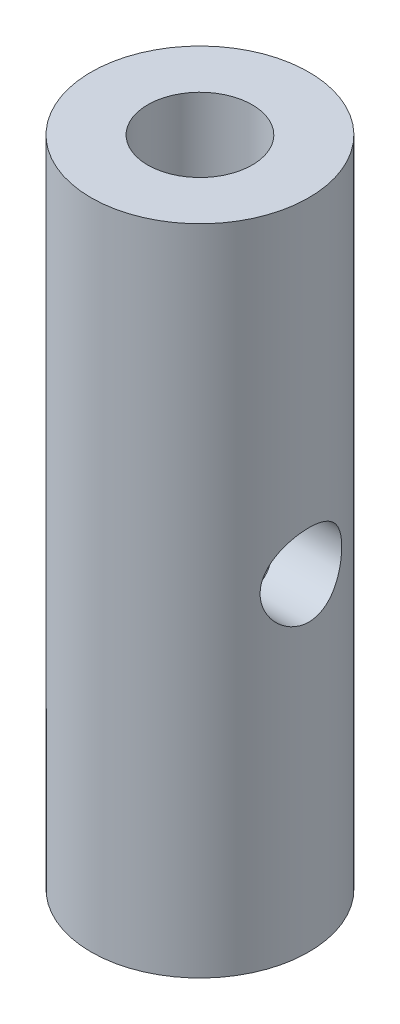
ISO-10303-21;
HEADER;
FILE_DESCRIPTION(('STEP AP214'),'2;1');
FILE_NAME('part.step','',(''),(''),'','','');
FILE_SCHEMA(('AUTOMOTIVE_DESIGN { 1 0 10303 214 1 1 1 1 }'));
ENDSEC;
DATA;
#1=APPLICATION_CONTEXT('core data for automotive mechanical design processes');
#2=APPLICATION_PROTOCOL_DEFINITION('international standard','automotive_design',2000,#1);
#3=PRODUCT_CONTEXT('',#1,'mechanical');
#4=PRODUCT('Part','Part','',(#3));
#5=PRODUCT_RELATED_PRODUCT_CATEGORY('part','',(#4));
#6=PRODUCT_DEFINITION_FORMATION('','',#4);
#7=PRODUCT_DEFINITION_CONTEXT('part definition',#1,'design');
#8=PRODUCT_DEFINITION('design','',#6,#7);
#9=PRODUCT_DEFINITION_SHAPE('','',#8);
#10=(LENGTH_UNIT() NAMED_UNIT(*) SI_UNIT(.MILLI.,.METRE.));
#11=(NAMED_UNIT(*) PLANE_ANGLE_UNIT() SI_UNIT($,.RADIAN.));
#12=(NAMED_UNIT(*) SI_UNIT($,.STERADIAN.) SOLID_ANGLE_UNIT());
#13=UNCERTAINTY_MEASURE_WITH_UNIT(LENGTH_MEASURE(1.E-05),#10,'distance_accuracy_value','');
#14=(GEOMETRIC_REPRESENTATION_CONTEXT(3) GLOBAL_UNCERTAINTY_ASSIGNED_CONTEXT((#13)) GLOBAL_UNIT_ASSIGNED_CONTEXT((#10,
#11,#12)) REPRESENTATION_CONTEXT('',''));
#15=CARTESIAN_POINT('',(0.,0.,0.));
#16=DIRECTION('',(0.,0.,1.));
#17=DIRECTION('',(1.,0.,0.));
#18=AXIS2_PLACEMENT_3D('',#15,#16,#17);
#19=CARTESIAN_POINT('',(0.,19.05,0.));
#20=DIRECTION('',(0.,-1.,0.));
#21=DIRECTION('',(0.,0.,-1.));
#22=AXIS2_PLACEMENT_3D('',#19,#20,#21);
#23=CYLINDRICAL_SURFACE('',#22,3.175);
#24=CARTESIAN_POINT('',(3.175,8.334375,0.));
#25=CARTESIAN_POINT('',(3.1750017260582,8.33437269629691,0.0644803280319207));
#26=CARTESIAN_POINT('',(3.17301863556027,8.33962943469716,0.128944879414298));
#27=CARTESIAN_POINT('',(3.16530589955499,8.36043237999551,0.255947427804686));
#28=CARTESIAN_POINT('',(3.15957679372107,8.37597710474851,0.31848570096517));
#29=CARTESIAN_POINT('',(3.14498698210789,8.41672894515634,0.43978574808651));
#30=CARTESIAN_POINT('',(3.13613231952368,8.4419174227273,0.498554552928807));
#31=CARTESIAN_POINT('',(3.11617334413749,8.50114696533131,0.611028202439701));
#32=CARTESIAN_POINT('',(3.10506842811866,8.53519040477567,0.664731683597441));
#33=CARTESIAN_POINT('',(3.08122833533403,8.61267369653754,0.767831218530124));
#34=CARTESIAN_POINT('',(3.06844702050705,8.6564233956684,0.816983642057508));
#35=CARTESIAN_POINT('',(3.04292175316616,8.75141953251046,0.907450095452756));
#36=CARTESIAN_POINT('',(3.03017781325932,8.80266825639475,0.948761726101169));
#37=CARTESIAN_POINT('',(3.00563336052824,8.91358823984655,1.02392323008938));
#38=CARTESIAN_POINT('',(2.99388727501525,8.97350596594574,1.05742893349134));
#39=CARTESIAN_POINT('',(2.97338639063463,9.09863588112126,1.11377925527679));
#40=CARTESIAN_POINT('',(2.96463039737106,9.16384594325436,1.13662813187983));
#41=CARTESIAN_POINT('',(2.95159440179158,9.29490516257995,1.17005442120179));
#42=CARTESIAN_POINT('',(2.94714552453478,9.36061837425813,1.1810967711723));
#43=CARTESIAN_POINT('',(2.94273336284839,9.49310407540761,1.19205022996995));
#44=CARTESIAN_POINT('',(2.94276822592073,9.55987611601286,1.19196593587088));
#45=CARTESIAN_POINT('',(2.94717399857943,9.68832956063778,1.18102403502952));
#46=CARTESIAN_POINT('',(2.95128528416453,9.75007646917257,1.17081148004021));
#47=CARTESIAN_POINT('',(2.96294919584751,9.87090605063422,1.14096933245487));
#48=CARTESIAN_POINT('',(2.97050234018473,9.92998832087477,1.12133832170211));
#49=CARTESIAN_POINT('',(2.98835526113513,10.0451261725093,1.07286225428949));
#50=CARTESIAN_POINT('',(2.99870429903107,10.1011033421088,1.04384989935074));
#51=CARTESIAN_POINT('',(3.02096654298085,10.2075819292128,0.977551335491412));
#52=CARTESIAN_POINT('',(3.03288028850369,10.2580814471563,0.940262269910616));
#53=CARTESIAN_POINT('',(3.05790630844421,10.3557416580229,0.855517884834481));
#54=CARTESIAN_POINT('',(3.07104532042939,10.4024498585938,0.807547746065834));
#55=CARTESIAN_POINT('',(3.09635309230243,10.4872932606758,0.704304368962597));
#56=CARTESIAN_POINT('',(3.10852170288599,10.5254271445933,0.649030010276033));
#57=CARTESIAN_POINT('',(3.13075950879707,10.5925385026684,0.531592978112733));
#58=CARTESIAN_POINT('',(3.1407933299357,10.6213652675942,0.469337004114246));
#59=CARTESIAN_POINT('',(3.15736857672026,10.6679861921393,0.340389250103887));
#60=CARTESIAN_POINT('',(3.1639115533356,10.6857852518954,0.273699454858827));
#61=CARTESIAN_POINT('',(3.17249526812277,10.7089755876114,0.141585349249252));
#62=CARTESIAN_POINT('',(3.17475686664138,10.7149761938161,0.0762822480275031));
#63=CARTESIAN_POINT('',(3.17520553124475,10.7161735319706,-0.0544294022336761));
#64=CARTESIAN_POINT('',(3.17339350069573,10.7113726592514,-0.119837924680553));
#65=CARTESIAN_POINT('',(3.16604419632035,10.6915664039175,-0.246270501045976));
#66=CARTESIAN_POINT('',(3.16065273826329,10.6769602121587,-0.307366454105823));
#67=CARTESIAN_POINT('',(3.1468335994155,10.6384835549156,-0.426197517997294));
#68=CARTESIAN_POINT('',(3.13840552373861,10.6146118845037,-0.483932190588356));
#69=CARTESIAN_POINT('',(3.11903764373597,10.5575207851262,-0.596302913556186));
#70=CARTESIAN_POINT('',(3.1080313141617,10.5240473024289,-0.650798072573999));
#71=CARTESIAN_POINT('',(3.08472420554452,10.4489900056076,-0.753580464933008));
#72=CARTESIAN_POINT('',(3.07242294938803,10.4074031972923,-0.80186539546467));
#73=CARTESIAN_POINT('',(3.04699455283473,10.3144604780639,-0.89378694650348));
#74=CARTESIAN_POINT('',(3.03386090349835,10.2626777674242,-0.936991348355824));
#75=CARTESIAN_POINT('',(3.00893809999065,10.1523392133883,-1.01418270962823));
#76=CARTESIAN_POINT('',(2.99714906660554,10.0937827624604,-1.04816884135274));
#77=CARTESIAN_POINT('',(2.9762992117158,9.97107481049948,-1.10599357730704));
#78=CARTESIAN_POINT('',(2.96724991010742,9.90690110793359,-1.12978950323491));
#79=CARTESIAN_POINT('',(2.95317888607235,9.77502350007279,-1.16608132501843));
#80=CARTESIAN_POINT('',(2.94815467214383,9.70732180626774,-1.17858421180018));
#81=CARTESIAN_POINT('',(2.94303366491605,9.57499342336424,-1.1913103800891));
#82=CARTESIAN_POINT('',(2.94264115340402,9.51044847357472,-1.19227069374821));
#83=CARTESIAN_POINT('',(2.94606990116576,9.38216840520579,-1.18377268040514));
#84=CARTESIAN_POINT('',(2.94989076088501,9.31843321041693,-1.17431534131035));
#85=CARTESIAN_POINT('',(2.96106962383437,9.19555626379374,-1.14582428656504));
#86=CARTESIAN_POINT('',(2.96831611517726,9.13633368766776,-1.12709164913741));
#87=CARTESIAN_POINT('',(2.98546478961414,9.02183750263256,-1.08084696819061));
#88=CARTESIAN_POINT('',(2.99536764396202,8.96656489634432,-1.0533327052505));
#89=CARTESIAN_POINT('',(3.01735905848772,8.85838748567751,-0.988632102759094));
#90=CARTESIAN_POINT('',(3.02953498137515,8.80575868004007,-0.951014360373892));
#91=CARTESIAN_POINT('',(3.0543995836351,8.70732513597911,-0.867842480481128));
#92=CARTESIAN_POINT('',(3.06708842498621,8.66152257501302,-0.822285820601664));
#93=CARTESIAN_POINT('',(3.09237399534093,8.57551469756642,-0.721582564947793));
#94=CARTESIAN_POINT('',(3.10492858264887,8.53574639571123,-0.666050423844062));
#95=CARTESIAN_POINT('',(3.12780770850268,8.46611951737423,-0.548650495915651));
#96=CARTESIAN_POINT('',(3.13813207344675,8.43626171223426,-0.48678221643443));
#97=CARTESIAN_POINT('',(3.15574594756552,8.38646339194289,-0.355599271339334));
#98=CARTESIAN_POINT('',(3.16288465369445,8.36700839247225,-0.286078153898402));
#99=CARTESIAN_POINT('',(3.17250954730047,8.34096871306296,-0.144363863550065));
#100=CARTESIAN_POINT('',(3.17499806804399,8.33437757850694,-0.0721720492396065));
#101=CARTESIAN_POINT('',(3.175,8.334375,0.));
#102=B_SPLINE_CURVE_WITH_KNOTS('',3,(#24,#25,#26,#27,#28,#29,#30,#31,#32,#33,#34,#35,#36,#37,
#38,#39,#40,#41,#42,#43,#44,#45,#46,#47,#48,#49,#50,#51,#52,#53,#54,#55,#56,#57,#58,#59,#60,#61,
#62,#63,#64,#65,#66,#67,#68,#69,#70,#71,#72,#73,#74,#75,#76,#77,#78,#79,#80,#81,#82,#83,#84,#85,
#86,#87,#88,#89,#90,#91,#92,#93,#94,#95,#96,#97,#98,#99,#100,#101),.UNSPECIFIED.,.T.,.F.,(4,2,2,
2,2,2,2,2,2,2,2,2,2,2,2,2,2,2,2,2,2,2,2,2,2,2,2,2,2,2,2,2,2,2,2,2,2,2,4),(0.,0.193174779988694,
0.386321736189803,0.579097274313272,0.771924557565032,0.972134347500304,1.17240530159712,
1.38030485385691,1.58812126298256,1.78741287818415,1.98662215450767,2.17390936438977,
2.36122478335592,2.55208411657195,2.74300942653255,2.94676634210301,3.15055454712146,
3.35749404133322,3.56434151635958,3.76019234336015,3.95599974284975,4.14428335102048,
4.33259145270722,4.52643257351057,4.7203453664077,4.92550862317928,5.13069029517861,
5.33672309214718,5.54262825746727,5.7353101851245,5.92797384230186,6.1147574430106,
6.30158828783601,6.4982127455814,6.69489978960167,6.90223036662893,7.10957707657799,
7.32590383806683,7.54212202675675),.UNSPECIFIED.);
#103=CARTESIAN_POINT('',(3.175,8.334375,0.));
#104=VERTEX_POINT('',#103);
#105=EDGE_CURVE('E52',#104,#104,#102,.T.);
#106=ORIENTED_EDGE('',*,*,#105,.T.);
#107=EDGE_LOOP('',(#106));
#108=FACE_BOUND('',#107,.T.);
#109=CARTESIAN_POINT('',(0.,19.05,0.));
#110=DIRECTION('',(0.,1.,0.));
#111=DIRECTION('',(0.,0.,1.));
#112=AXIS2_PLACEMENT_3D('',#109,#110,#111);
#113=CIRCLE('',#112,3.175);
#114=CARTESIAN_POINT('',(0.,19.05,3.175));
#115=VERTEX_POINT('',#114);
#116=EDGE_CURVE('E10',#115,#115,#113,.T.);
#117=ORIENTED_EDGE('',*,*,#116,.F.);
#118=EDGE_LOOP('',(#117));
#119=FACE_BOUND('',#118,.T.);
#120=CARTESIAN_POINT('',(0.,0.,0.));
#121=DIRECTION('',(0.,1.,0.));
#122=DIRECTION('',(0.,0.,1.));
#123=AXIS2_PLACEMENT_3D('',#120,#121,#122);
#124=CIRCLE('',#123,3.175);
#125=CARTESIAN_POINT('',(0.,0.,3.175));
#126=VERTEX_POINT('',#125);
#127=EDGE_CURVE('E41',#126,#126,#124,.T.);
#128=ORIENTED_EDGE('',*,*,#127,.T.);
#129=EDGE_LOOP('',(#128));
#130=FACE_BOUND('',#129,.T.);
#131=ADVANCED_FACE('F37',(#108,#119,#130),#23,.T.);
#132=CARTESIAN_POINT('',(0.,19.05,0.));
#133=DIRECTION('',(0.,1.,0.));
#134=DIRECTION('',(0.,0.,1.));
#135=AXIS2_PLACEMENT_3D('',#132,#133,#134);
#136=PLANE('',#135);
#137=CARTESIAN_POINT('',(0.,19.05,0.));
#138=DIRECTION('',(0.,1.,0.));
#139=DIRECTION('',(0.,0.,1.));
#140=AXIS2_PLACEMENT_3D('',#137,#138,#139);
#141=CIRCLE('',#140,1.52399999999999);
#142=CARTESIAN_POINT('',(0.,19.05,1.52399999999999));
#143=VERTEX_POINT('',#142);
#144=EDGE_CURVE('E48',#143,#143,#141,.T.);
#145=ORIENTED_EDGE('',*,*,#144,.F.);
#146=EDGE_LOOP('',(#145));
#147=FACE_BOUND('',#146,.T.);
#148=ORIENTED_EDGE('',*,*,#116,.T.);
#149=EDGE_LOOP('',(#148));
#150=FACE_BOUND('',#149,.T.);
#151=ADVANCED_FACE('F74',(#147,#150),#136,.T.);
#152=CARTESIAN_POINT('',(0.,0.,0.));
#153=DIRECTION('',(0.,1.,0.));
#154=DIRECTION('',(0.,0.,1.));
#155=AXIS2_PLACEMENT_3D('',#152,#153,#154);
#156=PLANE('',#155);
#157=CARTESIAN_POINT('',(0.,0.,0.));
#158=DIRECTION('',(0.,-1.,0.));
#159=DIRECTION('',(0.,0.,-1.));
#160=AXIS2_PLACEMENT_3D('',#157,#158,#159);
#161=CIRCLE('',#160,1.52399999999999);
#162=CARTESIAN_POINT('',(0.,0.,-1.52399999999999));
#163=VERTEX_POINT('',#162);
#164=EDGE_CURVE('E126',#163,#163,#161,.T.);
#165=ORIENTED_EDGE('',*,*,#164,.F.);
#166=EDGE_LOOP('',(#165));
#167=FACE_BOUND('',#166,.T.);
#168=ORIENTED_EDGE('',*,*,#127,.F.);
#169=EDGE_LOOP('',(#168));
#170=FACE_BOUND('',#169,.T.);
#171=ADVANCED_FACE('F72',(#167,#170),#156,.F.);
#172=CARTESIAN_POINT('',(0.,19.05,0.));
#173=DIRECTION('',(0.,1.,0.));
#174=DIRECTION('',(0.,0.,1.));
#175=AXIS2_PLACEMENT_3D('',#172,#173,#174);
#176=CYLINDRICAL_SURFACE('',#175,1.52399999999999);
#177=CARTESIAN_POINT('',(0.954355567582107,9.4488,-1.18818409795157));
#178=CARTESIAN_POINT('',(0.950306040576288,9.49960397933813,-1.19143950382867));
#179=CARTESIAN_POINT('',(0.950322024961533,9.55096708228768,-1.19142681434132));
#180=CARTESIAN_POINT('',(0.958487370695464,9.65265886233397,-1.18486244982264));
#181=CARTESIAN_POINT('',(0.966652051010902,9.7029854089043,-1.17829845881146));
#182=CARTESIAN_POINT('',(0.989212916288472,9.8002863083555,-1.15941334457762));
#183=CARTESIAN_POINT('',(1.00352831994747,9.84729522125103,-1.14716669400964));
#184=CARTESIAN_POINT('',(1.03629368819822,9.93817836290609,-1.11765784187556));
#185=CARTESIAN_POINT('',(1.05474899350194,9.98204844509891,-1.10038915298271));
#186=CARTESIAN_POINT('',(1.10515070640789,10.0905370951063,-1.05027896972019));
#187=CARTESIAN_POINT('',(1.13881977626374,10.1528412230609,-1.01415595107051));
#188=CARTESIAN_POINT('',(1.20722056306751,10.2697303649936,-0.931711156990104));
#189=CARTESIAN_POINT('',(1.24195423566525,10.3242999912947,-0.885369506940448));
#190=CARTESIAN_POINT('',(1.30953843758419,10.4257478008892,-0.782020682409392));
#191=CARTESIAN_POINT('',(1.34235447422765,10.4725033561654,-0.724868974395464));
#192=CARTESIAN_POINT('',(1.40222601587321,10.5555688518629,-0.600869348646764));
#193=CARTESIAN_POINT('',(1.42929892300499,10.5919104682376,-0.534051784976704));
#194=CARTESIAN_POINT('',(1.46776698595424,10.642826695657,-0.413473781656532));
#195=CARTESIAN_POINT('',(1.48142898705062,10.660660667569,-0.361805865797958));
#196=CARTESIAN_POINT('',(1.50341767113159,10.689199574534,-0.255441605539634));
#197=CARTESIAN_POINT('',(1.5117483087473,10.6999097939861,-0.200747538635676));
#198=CARTESIAN_POINT('',(1.52239219996221,10.7135741154454,-0.0895891809482531));
#199=CARTESIAN_POINT('',(1.52468201427019,10.7164980057518,-0.0331188525127413));
#200=CARTESIAN_POINT('',(1.522964012338,10.714298891507,0.0795698641469652));
#201=CARTESIAN_POINT('',(1.51895602122089,10.7091756635041,0.135788245331638));
#202=CARTESIAN_POINT('',(1.50542467191675,10.6917659248999,0.242940494700542));
#203=CARTESIAN_POINT('',(1.49623932703772,10.6799181370228,0.293990753260973));
#204=CARTESIAN_POINT('',(1.47329663576187,10.6500361161906,0.393148364372812));
#205=CARTESIAN_POINT('',(1.45953816925783,10.6320003675663,0.441254992511228));
#206=CARTESIAN_POINT('',(1.42696851965417,10.5887068747384,0.537724528434047));
#207=CARTESIAN_POINT('',(1.40782465834247,10.5629615812962,0.58575397143625));
#208=CARTESIAN_POINT('',(1.36634576177923,10.5059661247386,0.676895023534505));
#209=CARTESIAN_POINT('',(1.34400906799772,10.4747130986315,0.720004055639901));
#210=CARTESIAN_POINT('',(1.29271212388883,10.4007651962789,0.809077298311732));
#211=CARTESIAN_POINT('',(1.26331492553885,10.3570295907913,0.853924312045559));
#212=CARTESIAN_POINT('',(1.20369616626334,10.263381596553,0.936092525940789));
#213=CARTESIAN_POINT('',(1.17347360708701,10.2134614441434,0.973404108976399));
#214=CARTESIAN_POINT('',(1.11691667715813,10.1116640971318,1.0376721642466));
#215=CARTESIAN_POINT('',(1.09046057307972,10.0602126948399,1.06519448976127));
#216=CARTESIAN_POINT('',(1.0417115381628,9.95218302415118,1.11291159141503));
#217=CARTESIAN_POINT('',(1.0194096869804,9.89561613765589,1.13312215803202));
#218=CARTESIAN_POINT('',(0.988040928815939,9.79483363014843,1.16045415186525));
#219=CARTESIAN_POINT('',(0.977011242306009,9.75181026924068,1.16967283072831));
#220=CARTESIAN_POINT('',(0.960455302262841,9.66400973609588,1.18330982065928));
#221=CARTESIAN_POINT('',(0.954914126153823,9.61923766525469,1.18774115092741));
#222=CARTESIAN_POINT('',(0.951498893531055,9.55333850676247,1.190472765547));
#223=CARTESIAN_POINT('',(0.951107846287349,9.53239171133371,1.19078568527106));
#224=CARTESIAN_POINT('',(0.951701997241996,9.49053706480299,1.19031043016212));
#225=CARTESIAN_POINT('',(0.952686830662978,9.46962920484974,1.18952254717704));
#226=CARTESIAN_POINT('',(0.959029414889882,9.39046095212848,1.18443533010366));
#227=CARTESIAN_POINT('',(0.969068242312398,9.33273892561649,1.1763675655851));
#228=CARTESIAN_POINT('',(0.997239867507577,9.22085810404649,1.15256699501556));
#229=CARTESIAN_POINT('',(1.01542145252526,9.16672307886038,1.13678793405151));
#230=CARTESIAN_POINT('',(1.0619092559771,9.04930591230591,1.09369447866579));
#231=CARTESIAN_POINT('',(1.09161901785975,8.98731117261422,1.06444649144569));
#232=CARTESIAN_POINT('',(1.15379608680864,8.87023901730436,0.996721870633589));
#233=CARTESIAN_POINT('',(1.18626461086936,8.81516468137342,0.958241150338392));
#234=CARTESIAN_POINT('',(1.25150223463718,8.71077651745277,0.87140328199912));
#235=CARTESIAN_POINT('',(1.28425948804693,8.66163504494292,0.822828997535269));
#236=CARTESIAN_POINT('',(1.34637554784652,8.57169539935347,0.716672006569838));
#237=CARTESIAN_POINT('',(1.37574022856887,8.53088270788839,0.659105290074357));
#238=CARTESIAN_POINT('',(1.42272089418995,8.46693264771924,0.548837631933361));
#239=CARTESIAN_POINT('',(1.44150558980895,8.44188166988305,0.497748761313327));
#240=CARTESIAN_POINT('',(1.47401260831551,8.39897960091154,0.391103108509892));
#241=CARTESIAN_POINT('',(1.487738234908,8.38112381041677,0.335549271045234));
#242=CARTESIAN_POINT('',(1.50904216013346,8.35354893271743,0.220878046323188));
#243=CARTESIAN_POINT('',(1.51657888745802,8.34388485613456,0.161739380449658));
#244=CARTESIAN_POINT('',(1.524589982649,8.33361526865329,0.0422113756352892));
#245=CARTESIAN_POINT('',(1.5250679812852,8.33300510073165,-0.0181773043319236));
#246=CARTESIAN_POINT('',(1.51926183566455,8.34044445724087,-0.131488582590186));
#247=CARTESIAN_POINT('',(1.51370137789979,8.3475671960494,-0.184514021804272));
#248=CARTESIAN_POINT('',(1.49739360433753,8.36860749890542,-0.288361234980468));
#249=CARTESIAN_POINT('',(1.48664524891733,8.38252642487337,-0.339182565027049));
#250=CARTESIAN_POINT('',(1.46036680572736,8.41693414854137,-0.438908788355196));
#251=CARTESIAN_POINT('',(1.44471062539868,8.4375968640464,-0.487719457364167));
#252=CARTESIAN_POINT('',(1.40973827769497,8.48451072724587,-0.581123590472968));
#253=CARTESIAN_POINT('',(1.39042146323748,8.5107628630717,-0.625716306881937));
#254=CARTESIAN_POINT('',(1.34567349438243,8.57295241897272,-0.717470614608918));
#255=CARTESIAN_POINT('',(1.31976069300783,8.60977680364806,-0.763793672779558));
#256=CARTESIAN_POINT('',(1.26596981359782,8.68920925662105,-0.849991247076888));
#257=CARTESIAN_POINT('',(1.23808816622016,8.73182796597616,-0.88985359598841));
#258=CARTESIAN_POINT('',(1.1762380596778,8.8318738523478,-0.970636572830648));
#259=CARTESIAN_POINT('',(1.14222507855431,8.8905290386833,-1.01001001740485));
#260=CARTESIAN_POINT('',(1.07784439188857,9.01546221860127,-1.07843332305586));
#261=CARTESIAN_POINT('',(1.0474716147671,9.0817293488134,-1.10749766027091));
#262=CARTESIAN_POINT('',(1.00486270898589,9.19845553723044,-1.14602161695581));
#263=CARTESIAN_POINT('',(0.98995591947722,9.24681911778013,-1.15878678607976));
#264=CARTESIAN_POINT('',(0.966771053971151,9.34620367226804,-1.17820348097874));
#265=CARTESIAN_POINT('',(0.958467460677833,9.39721359705079,-1.18487855611161));
#266=CARTESIAN_POINT('',(0.954355567582107,9.4488,-1.18818409795157));
#267=B_SPLINE_CURVE_WITH_KNOTS('',3,(#177,#178,#179,#180,#181,#182,#183,#184,#185,#186,#187,
#188,#189,#190,#191,#192,#193,#194,#195,#196,#197,#198,#199,#200,#201,#202,#203,#204,#205,#206,
#207,#208,#209,#210,#211,#212,#213,#214,#215,#216,#217,#218,#219,#220,#221,#222,#223,#224,#225,
#226,#227,#228,#229,#230,#231,#232,#233,#234,#235,#236,#237,#238,#239,#240,#241,#242,#243,#244,
#245,#246,#247,#248,#249,#250,#251,#252,#253,#254,#255,#256,#257,#258,#259,#260,#261,#262,#263,
#264,#265,#266),.UNSPECIFIED.,.T.,.F.,(4,2,2,2,2,2,2,2,2,2,2,2,2,2,2,2,2,2,2,2,2,2,2,2,2,2,2,2,
2,2,2,2,2,2,2,2,2,2,2,2,2,2,2,2,4),(0.,0.152965144875636,0.306218395989664,0.45751761227289,
0.609013147384288,0.846276312726828,1.08400507596473,1.32517138944576,1.56559616896479,
1.73392838772496,1.9021355979792,2.0709945237338,2.23985813843162,2.39879673774282,
2.55777429504331,2.73041813556198,2.90315198475545,3.10999556329337,3.31710148143935,
3.50871367295199,3.69990955307006,3.83550148698697,3.97072374299032,4.03351595687884,
4.09629152627695,4.27211518227806,4.449006677281,4.67194691606306,4.89498601797322,
5.12344111777551,5.35149451690073,5.53054865731161,5.70948566263195,5.88961499038014,
6.06965166250381,6.23027275080548,6.39092603995427,6.55610187428173,6.72130693366953,
6.91441923051534,7.10789108571054,7.34213353371465,7.57604574198202,7.73197220610572,
7.88729314166114),.UNSPECIFIED.);
#268=CARTESIAN_POINT('',(0.954355567582107,9.4488,-1.18818409795157));
#269=VERTEX_POINT('',#268);
#270=EDGE_CURVE('E58',#269,#269,#267,.T.);
#271=ORIENTED_EDGE('',*,*,#270,.T.);
#272=EDGE_LOOP('',(#271));
#273=FACE_BOUND('',#272,.T.);
#274=ORIENTED_EDGE('',*,*,#144,.T.);
#275=EDGE_LOOP('',(#274));
#276=FACE_BOUND('',#275,.T.);
#277=ORIENTED_EDGE('',*,*,#164,.T.);
#278=EDGE_LOOP('',(#277));
#279=FACE_BOUND('',#278,.T.);
#280=ADVANCED_FACE('F66',(#273,#276,#279),#176,.F.);
#281=CARTESIAN_POINT('',(0.,9.525,0.));
#282=DIRECTION('',(-1.,0.,0.));
#283=DIRECTION('',(0.,0.,1.));
#284=AXIS2_PLACEMENT_3D('',#281,#282,#283);
#285=CYLINDRICAL_SURFACE('',#284,1.190625);
#286=ORIENTED_EDGE('',*,*,#270,.F.);
#287=EDGE_LOOP('',(#286));
#288=FACE_BOUND('',#287,.T.);
#289=ORIENTED_EDGE('',*,*,#105,.F.);
#290=EDGE_LOOP('',(#289));
#291=FACE_BOUND('',#290,.T.);
#292=ADVANCED_FACE('F63',(#288,#291),#285,.F.);
#293=CLOSED_SHELL('',(#131,#151,#171,#280,#292));
#294=MANIFOLD_SOLID_BREP('B2',#293);
#295=ADVANCED_BREP_SHAPE_REPRESENTATION('',(#18,#294),#14);
#296=SHAPE_DEFINITION_REPRESENTATION(#9,#295);
ENDSEC;
END-ISO-10303-21;
